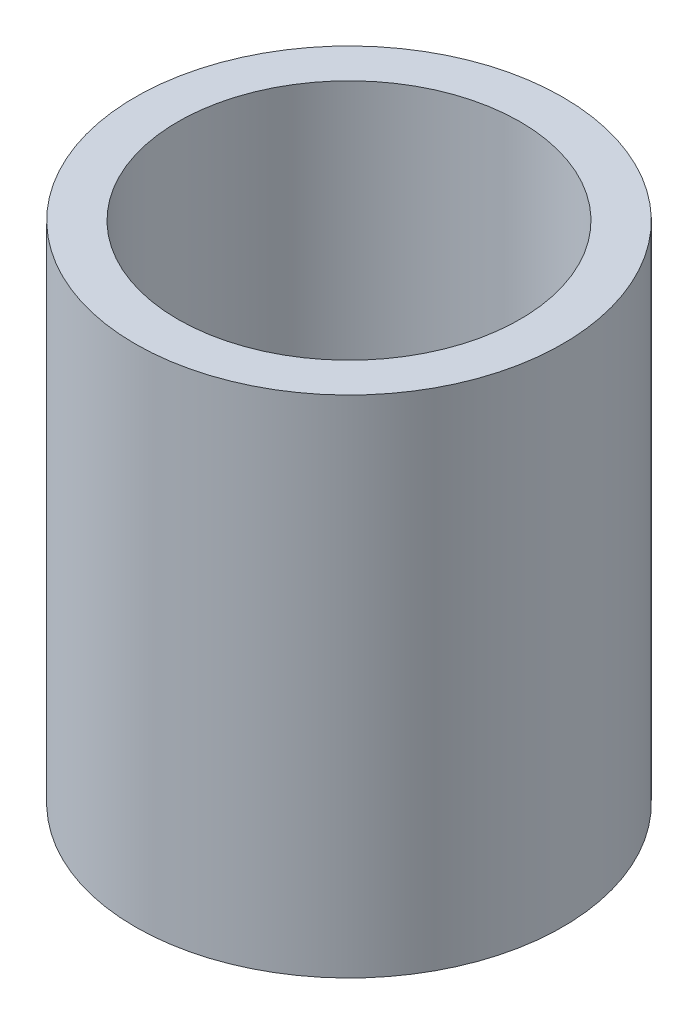
ISO-10303-21;
HEADER;
FILE_DESCRIPTION(('STEP AP214'),'2;1');
FILE_NAME('part.step','',(''),(''),'','','');
FILE_SCHEMA(('AUTOMOTIVE_DESIGN { 1 0 10303 214 1 1 1 1 }'));
ENDSEC;
DATA;
#1=APPLICATION_CONTEXT('core data for automotive mechanical design processes');
#2=APPLICATION_PROTOCOL_DEFINITION('international standard','automotive_design',2000,#1);
#3=PRODUCT_CONTEXT('',#1,'mechanical');
#4=PRODUCT('Part','Part','',(#3));
#5=PRODUCT_RELATED_PRODUCT_CATEGORY('part','',(#4));
#6=PRODUCT_DEFINITION_FORMATION('','',#4);
#7=PRODUCT_DEFINITION_CONTEXT('part definition',#1,'design');
#8=PRODUCT_DEFINITION('design','',#6,#7);
#9=PRODUCT_DEFINITION_SHAPE('','',#8);
#10=(LENGTH_UNIT() NAMED_UNIT(*) SI_UNIT(.MILLI.,.METRE.));
#11=(NAMED_UNIT(*) PLANE_ANGLE_UNIT() SI_UNIT($,.RADIAN.));
#12=(NAMED_UNIT(*) SI_UNIT($,.STERADIAN.) SOLID_ANGLE_UNIT());
#13=UNCERTAINTY_MEASURE_WITH_UNIT(LENGTH_MEASURE(1.E-05),#10,'distance_accuracy_value','');
#14=(GEOMETRIC_REPRESENTATION_CONTEXT(3) GLOBAL_UNCERTAINTY_ASSIGNED_CONTEXT((#13)) GLOBAL_UNIT_ASSIGNED_CONTEXT((#10,
#11,#12)) REPRESENTATION_CONTEXT('',''));
#15=CARTESIAN_POINT('',(0.,0.,0.));
#16=DIRECTION('',(0.,0.,1.));
#17=DIRECTION('',(1.,0.,0.));
#18=AXIS2_PLACEMENT_3D('',#15,#16,#17);
#19=CARTESIAN_POINT('',(0.,64.947973413106,0.));
#20=DIRECTION('',(0.,-1.,0.));
#21=DIRECTION('',(0.,0.,-1.));
#22=AXIS2_PLACEMENT_3D('',#19,#20,#21);
#23=CYLINDRICAL_SURFACE('',#22,27.5);
#24=CARTESIAN_POINT('',(0.,64.947973413106,0.));
#25=DIRECTION('',(0.,1.,0.));
#26=DIRECTION('',(0.,0.,1.));
#27=AXIS2_PLACEMENT_3D('',#24,#25,#26);
#28=CIRCLE('',#27,27.5);
#29=CARTESIAN_POINT('',(0.,64.947973413106,27.5));
#30=VERTEX_POINT('',#29);
#31=EDGE_CURVE('E10',#30,#30,#28,.T.);
#32=ORIENTED_EDGE('',*,*,#31,.F.);
#33=EDGE_LOOP('',(#32));
#34=FACE_BOUND('',#33,.T.);
#35=CARTESIAN_POINT('',(0.,0.,0.));
#36=DIRECTION('',(0.,1.,0.));
#37=DIRECTION('',(0.,0.,1.));
#38=AXIS2_PLACEMENT_3D('',#35,#36,#37);
#39=CIRCLE('',#38,27.5);
#40=CARTESIAN_POINT('',(0.,0.,27.5));
#41=VERTEX_POINT('',#40);
#42=EDGE_CURVE('E37',#41,#41,#39,.T.);
#43=ORIENTED_EDGE('',*,*,#42,.T.);
#44=EDGE_LOOP('',(#43));
#45=FACE_BOUND('',#44,.T.);
#46=ADVANCED_FACE('F40',(#34,#45),#23,.T.);
#47=CARTESIAN_POINT('',(0.,64.947973413106,0.));
#48=DIRECTION('',(0.,1.,0.));
#49=DIRECTION('',(0.,0.,1.));
#50=AXIS2_PLACEMENT_3D('',#47,#48,#49);
#51=PLANE('',#50);
#52=CARTESIAN_POINT('',(0.,64.947973413106,0.));
#53=DIRECTION('',(0.,1.,0.));
#54=DIRECTION('',(0.,0.,1.));
#55=AXIS2_PLACEMENT_3D('',#52,#53,#54);
#56=CIRCLE('',#55,22.0153234829027);
#57=CARTESIAN_POINT('',(0.,64.947973413106,22.0153234829027));
#58=VERTEX_POINT('',#57);
#59=EDGE_CURVE('E50',#58,#58,#56,.T.);
#60=ORIENTED_EDGE('',*,*,#59,.F.);
#61=EDGE_LOOP('',(#60));
#62=FACE_BOUND('',#61,.T.);
#63=ORIENTED_EDGE('',*,*,#31,.T.);
#64=EDGE_LOOP('',(#63));
#65=FACE_BOUND('',#64,.T.);
#66=ADVANCED_FACE('F59',(#62,#65),#51,.T.);
#67=CARTESIAN_POINT('',(0.,0.,0.));
#68=DIRECTION('',(0.,1.,0.));
#69=DIRECTION('',(0.,0.,1.));
#70=AXIS2_PLACEMENT_3D('',#67,#68,#69);
#71=PLANE('',#70);
#72=CARTESIAN_POINT('',(0.,0.,0.));
#73=DIRECTION('',(0.,1.,0.));
#74=DIRECTION('',(0.,0.,1.));
#75=AXIS2_PLACEMENT_3D('',#72,#73,#74);
#76=CIRCLE('',#75,22.0153234829027);
#77=CARTESIAN_POINT('',(0.,0.,22.0153234829027));
#78=VERTEX_POINT('',#77);
#79=EDGE_CURVE('E47',#78,#78,#76,.T.);
#80=ORIENTED_EDGE('',*,*,#79,.T.);
#81=EDGE_LOOP('',(#80));
#82=FACE_BOUND('',#81,.T.);
#83=ORIENTED_EDGE('',*,*,#42,.F.);
#84=EDGE_LOOP('',(#83));
#85=FACE_BOUND('',#84,.T.);
#86=ADVANCED_FACE('F58',(#82,#85),#71,.F.);
#87=CARTESIAN_POINT('',(0.,64.947973413106,0.));
#88=DIRECTION('',(0.,-1.,0.));
#89=DIRECTION('',(0.,0.,-1.));
#90=AXIS2_PLACEMENT_3D('',#87,#88,#89);
#91=CYLINDRICAL_SURFACE('',#90,22.0153234829027);
#92=ORIENTED_EDGE('',*,*,#59,.T.);
#93=EDGE_LOOP('',(#92));
#94=FACE_BOUND('',#93,.T.);
#95=ORIENTED_EDGE('',*,*,#79,.F.);
#96=EDGE_LOOP('',(#95));
#97=FACE_BOUND('',#96,.T.);
#98=ADVANCED_FACE('F54',(#94,#97),#91,.F.);
#99=CLOSED_SHELL('',(#46,#66,#86,#98));
#100=MANIFOLD_SOLID_BREP('B2',#99);
#101=ADVANCED_BREP_SHAPE_REPRESENTATION('',(#18,#100),#14);
#102=SHAPE_DEFINITION_REPRESENTATION(#9,#101);
ENDSEC;
END-ISO-10303-21;
